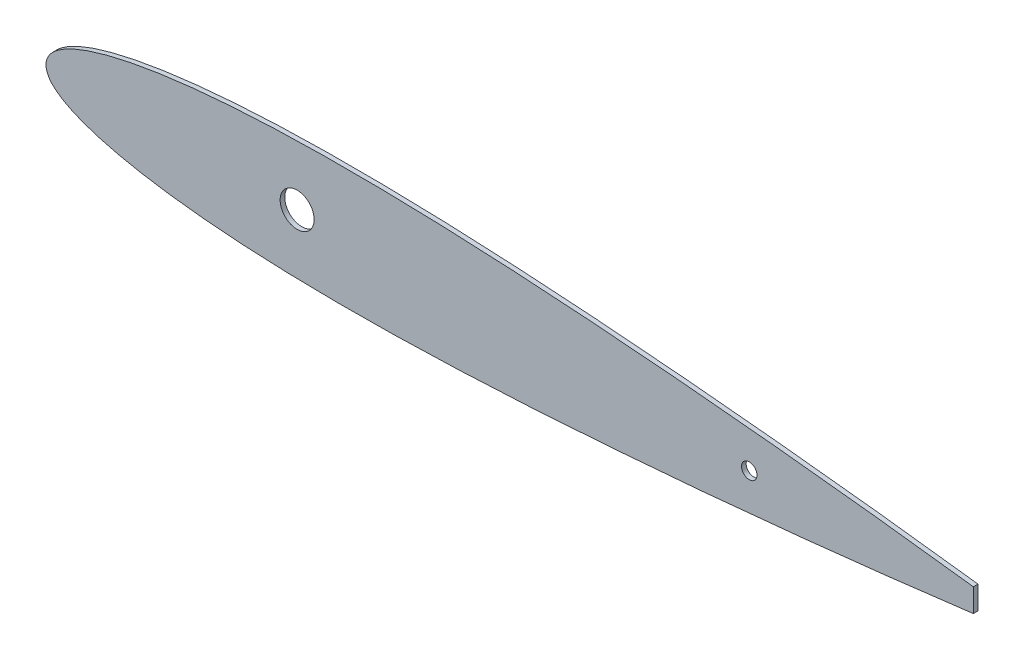
ISO-10303-21;
HEADER;
FILE_DESCRIPTION(('STEP AP214'),'2;1');
FILE_NAME('part.step','',(''),(''),'','','');
FILE_SCHEMA(('AUTOMOTIVE_DESIGN { 1 0 10303 214 1 1 1 1 }'));
ENDSEC;
DATA;
#1=APPLICATION_CONTEXT('core data for automotive mechanical design processes');
#2=APPLICATION_PROTOCOL_DEFINITION('international standard','automotive_design',2000,#1);
#3=PRODUCT_CONTEXT('',#1,'mechanical');
#4=PRODUCT('Part','Part','',(#3));
#5=PRODUCT_RELATED_PRODUCT_CATEGORY('part','',(#4));
#6=PRODUCT_DEFINITION_FORMATION('','',#4);
#7=PRODUCT_DEFINITION_CONTEXT('part definition',#1,'design');
#8=PRODUCT_DEFINITION('design','',#6,#7);
#9=PRODUCT_DEFINITION_SHAPE('','',#8);
#10=(LENGTH_UNIT() NAMED_UNIT(*) SI_UNIT(.MILLI.,.METRE.));
#11=(NAMED_UNIT(*) PLANE_ANGLE_UNIT() SI_UNIT($,.RADIAN.));
#12=(NAMED_UNIT(*) SI_UNIT($,.STERADIAN.) SOLID_ANGLE_UNIT());
#13=UNCERTAINTY_MEASURE_WITH_UNIT(LENGTH_MEASURE(1.E-05),#10,'distance_accuracy_value','');
#14=(GEOMETRIC_REPRESENTATION_CONTEXT(3) GLOBAL_UNCERTAINTY_ASSIGNED_CONTEXT((#13)) GLOBAL_UNIT_ASSIGNED_CONTEXT((#10,
#11,#12)) REPRESENTATION_CONTEXT('',''));
#15=CARTESIAN_POINT('',(0.,0.,0.));
#16=DIRECTION('',(0.,0.,1.));
#17=DIRECTION('',(1.,0.,0.));
#18=AXIS2_PLACEMENT_3D('',#15,#16,#17);
#19=CARTESIAN_POINT('',(325.,0.409500092940086,-1.5));
#20=CARTESIAN_POINT('',(324.209606779707,0.519399758051775,-1.5));
#21=CARTESIAN_POINT('',(322.004222005564,0.826045920870351,-1.5));
#22=CARTESIAN_POINT('',(318.131286115593,1.36247994030202,-1.5));
#23=CARTESIAN_POINT('',(313.205110101778,2.03042977355134,-1.5));
#24=CARTESIAN_POINT('',(307.754214134533,2.75656118582943,-1.5));
#25=CARTESIAN_POINT('',(301.981376014148,3.50796663812488,-1.5));
#26=CARTESIAN_POINT('',(296.03805070342,4.26285960586597,-1.5));
#27=CARTESIAN_POINT('',(290.014777157156,5.01477274252765,-1.5));
#28=CARTESIAN_POINT('',(283.957433959712,5.75582617177158,-1.5));
#29=CARTESIAN_POINT('',(277.884033962146,6.48070926721199,-1.5));
#30=CARTESIAN_POINT('',(271.799371840249,7.19115834138845,-1.5));
#31=CARTESIAN_POINT('',(265.708673260099,7.88859596106562,-1.5));
#32=CARTESIAN_POINT('',(259.617942627013,8.57158743858235,-1.5));
#33=CARTESIAN_POINT('',(253.527208066558,9.23757681253481,-1.5));
#34=CARTESIAN_POINT('',(247.432327629463,9.88675115402497,-1.5));
#35=CARTESIAN_POINT('',(241.332260132785,10.5225031273384,-1.5));
#36=CARTESIAN_POINT('',(235.230560492259,11.1447506557479,-1.5));
#37=CARTESIAN_POINT('',(229.13083924923,11.7508555070343,-1.5));
#38=CARTESIAN_POINT('',(223.034064985933,12.3409491955804,-1.5));
#39=CARTESIAN_POINT('',(216.939113887928,12.9142946059519,-1.5));
#40=CARTESIAN_POINT('',(210.845263014783,13.4708382241848,-1.5));
#41=CARTESIAN_POINT('',(204.753002950035,14.0095743054649,-1.5));
#42=CARTESIAN_POINT('',(198.663296519111,14.5308590099606,-1.5));
#43=CARTESIAN_POINT('',(192.576797706318,15.0327448367373,-1.5));
#44=CARTESIAN_POINT('',(186.493961902939,15.5146771463487,-1.5));
#45=CARTESIAN_POINT('',(180.415624113057,15.9768096198057,-1.5));
#46=CARTESIAN_POINT('',(174.342680028815,16.4170842141137,-1.5));
#47=CARTESIAN_POINT('',(168.275982363255,16.8340297465507,-1.5));
#48=CARTESIAN_POINT('',(162.215629607513,17.2278742693412,-1.5));
#49=CARTESIAN_POINT('',(156.161040662733,17.5953372871964,-1.5));
#50=CARTESIAN_POINT('',(150.112779892537,17.9372096616026,-1.5));
#51=CARTESIAN_POINT('',(144.07339040427,18.2513514924437,-1.5));
#52=CARTESIAN_POINT('',(138.046350310496,18.536066857256,-1.5));
#53=CARTESIAN_POINT('',(132.034044160048,18.7892202902567,-1.5));
#54=CARTESIAN_POINT('',(126.0357766507,19.0073658596617,-1.5));
#55=CARTESIAN_POINT('',(120.050052914781,19.1887400668419,-1.5));
#56=CARTESIAN_POINT('',(114.076331660156,19.3315438188047,-1.5));
#57=CARTESIAN_POINT('',(108.117235085,19.435103873437,-1.5));
#58=CARTESIAN_POINT('',(102.177171609536,19.4963107318144,-1.5));
#59=CARTESIAN_POINT('',(96.2603591758064,19.5109725894807,-1.5));
#60=CARTESIAN_POINT('',(90.3701487394851,19.477507746131,-1.5));
#61=CARTESIAN_POINT('',(84.5091329996222,19.3907618385161,-1.5));
#62=CARTESIAN_POINT('',(78.6807707597626,19.2476243031364,-1.5));
#63=CARTESIAN_POINT('',(72.8895764419092,19.0443694156847,-1.5));
#64=CARTESIAN_POINT('',(67.1420867990853,18.7758127059806,-1.5));
#65=CARTESIAN_POINT('',(61.4473554716223,18.4394562222854,-1.5));
#66=CARTESIAN_POINT('',(55.8188788592684,18.0277086658522,-1.5));
#67=CARTESIAN_POINT('',(50.2754905068751,17.5393749526799,-1.5));
#68=CARTESIAN_POINT('',(44.8436271748396,16.966812040394,-1.5));
#69=CARTESIAN_POINT('',(39.5585789155564,16.3084644660726,-1.5));
#70=CARTESIAN_POINT('',(34.4705276450858,15.5627624363053,-1.5));
#71=CARTESIAN_POINT('',(29.6466115538617,14.7371020011183,-1.5));
#72=CARTESIAN_POINT('',(25.1714180911801,13.847801872696,-1.5));
#73=CARTESIAN_POINT('',(21.1277937118721,12.9136079104224,-1.5));
#74=CARTESIAN_POINT('',(17.5697242584202,11.9649836606135,-1.5));
#75=CARTESIAN_POINT('',(14.5048810711103,11.0230017776017,-1.5));
#76=CARTESIAN_POINT('',(11.9002690745363,10.1112925690979,-1.5));
#77=CARTESIAN_POINT('',(9.70828673327445,9.23223688296207,-1.5));
#78=CARTESIAN_POINT('',(7.87282777342704,8.39255923934502,-1.5));
#79=CARTESIAN_POINT('',(6.33315120465825,7.59484614670781,-1.5));
#80=CARTESIAN_POINT('',(5.03494774774099,6.82568841763681,-1.5));
#81=CARTESIAN_POINT('',(3.930515343935,6.07372451832533,-1.5));
#82=CARTESIAN_POINT('',(2.98116190312321,5.33718940017346,-1.5));
#83=CARTESIAN_POINT('',(2.17337222995275,4.60407807520939,-1.5));
#84=CARTESIAN_POINT('',(1.50639491985592,3.86778199385354,-1.5));
#85=CARTESIAN_POINT('',(0.976010289153697,3.13185481720186,-1.5));
#86=CARTESIAN_POINT('',(0.573308222912518,2.40523809189431,-1.5));
#87=CARTESIAN_POINT('',(0.282112492358061,1.69699756557873,-1.5));
#88=CARTESIAN_POINT('',(0.092781659396528,1.00862248430014,-1.5));
#89=CARTESIAN_POINT('',(-0.0038754219919416,0.334729508331888,-1.5));
#90=CARTESIAN_POINT('',(-0.00387542199174033,-0.334729508332765,-1.5));
#91=CARTESIAN_POINT('',(0.0927816593965284,-1.00862248430096,-1.5));
#92=CARTESIAN_POINT('',(0.282112492358257,-1.69699756557952,-1.5));
#93=CARTESIAN_POINT('',(0.573308222913153,-2.40523809189511,-1.5));
#94=CARTESIAN_POINT('',(0.976010289154229,-3.13185481720259,-1.5));
#95=CARTESIAN_POINT('',(1.50639491985669,-3.86778199385375,-1.5));
#96=CARTESIAN_POINT('',(2.17337222995331,-4.60407807521166,-1.5));
#97=CARTESIAN_POINT('',(2.98116190312569,-5.33718940016601,-1.5));
#98=CARTESIAN_POINT('',(3.93051534393069,-6.07372451835889,-1.5));
#99=CARTESIAN_POINT('',(5.03494774776691,-6.82568841748965,-1.5));
#100=CARTESIAN_POINT('',(6.33315120454887,-7.59484614737161,-1.5));
#101=CARTESIAN_POINT('',(7.87282777394364,-8.39255923625805,-1.5));
#102=CARTESIAN_POINT('',(9.7082867308385,-9.23223689756832,-1.5));
#103=CARTESIAN_POINT('',(11.9002690861303,-10.1112924996381,-1.5));
#104=CARTESIAN_POINT('',(14.5048810162984,-11.023002106052,-1.5));
#105=CARTESIAN_POINT('',(17.5697245150946,-11.964982122603,-1.5));
#106=CARTESIAN_POINT('',(21.1277925315337,-12.9136149831514,-1.5));
#107=CARTESIAN_POINT('',(25.1714233397692,-13.8477704225799,-1.5));
#108=CARTESIAN_POINT('',(29.6465711781048,-14.7372325178627,-1.5));
#109=CARTESIAN_POINT('',(34.4705986764643,-15.5622096745657,-1.5));
#110=CARTESIAN_POINT('',(39.5585394288992,-16.3086186388566,-1.5));
#111=CARTESIAN_POINT('',(44.8436338253308,-16.9667684771388,-1.5));
#112=CARTESIAN_POINT('',(50.2754886705652,-17.5393869812259,-1.5));
#113=CARTESIAN_POINT('',(55.8188793624641,-18.0277053697381,-1.5));
#114=CARTESIAN_POINT('',(61.4473553344781,-18.4394571206421,-1.5));
#115=CARTESIAN_POINT('',(67.142086836335,-18.7758124619893,-1.5));
#116=CARTESIAN_POINT('',(72.8895764318215,-19.044369481772,-1.5));
#117=CARTESIAN_POINT('',(78.6807707624954,-19.2476242852421,-1.5));
#118=CARTESIAN_POINT('',(84.5091329988881,-19.3907618433307,-1.5));
#119=CARTESIAN_POINT('',(90.3701487396878,-19.4775077448097,-1.5));
#120=CARTESIAN_POINT('',(96.2603591757564,-19.5109725898145,-1.5));
#121=CARTESIAN_POINT('',(102.177171609554,-19.4963107317,-1.5));
#122=CARTESIAN_POINT('',(108.117235085,-19.4351038734419,-1.5));
#123=CARTESIAN_POINT('',(114.07633166016,-19.3315438187761,-1.5));
#124=CARTESIAN_POINT('',(120.050052914784,-19.1887400668207,-1.5));
#125=CARTESIAN_POINT('',(126.035776650705,-19.0073658596371,-1.5));
#126=CARTESIAN_POINT('',(132.034044160051,-18.7892202902313,-1.5));
#127=CARTESIAN_POINT('',(138.046350310499,-18.5360668572294,-1.5));
#128=CARTESIAN_POINT('',(144.073390404273,-18.2513514924159,-1.5));
#129=CARTESIAN_POINT('',(150.11277989254,-17.9372096615736,-1.5));
#130=CARTESIAN_POINT('',(156.161040662736,-17.5953372871662,-1.5));
#131=CARTESIAN_POINT('',(162.215629607516,-17.2278742693098,-1.5));
#132=CARTESIAN_POINT('',(168.275982363258,-16.8340297465181,-1.5));
#133=CARTESIAN_POINT('',(174.342680028818,-16.4170842140799,-1.5));
#134=CARTESIAN_POINT('',(180.41562411306,-15.9768096197708,-1.5));
#135=CARTESIAN_POINT('',(186.493961902942,-15.5146771463126,-1.5));
#136=CARTESIAN_POINT('',(192.57679770632,-15.0327448366998,-1.5));
#137=CARTESIAN_POINT('',(198.663296519114,-14.530859009922,-1.5));
#138=CARTESIAN_POINT('',(204.753002950038,-14.0095743054252,-1.5));
#139=CARTESIAN_POINT('',(210.845263014786,-13.4708382241438,-1.5));
#140=CARTESIAN_POINT('',(216.93911388793,-12.9142946059096,-1.5));
#141=CARTESIAN_POINT('',(223.034064985936,-12.3409491955369,-1.5));
#142=CARTESIAN_POINT('',(229.130839249232,-11.7508555069896,-1.5));
#143=CARTESIAN_POINT('',(235.230560492261,-11.144750655702,-1.5));
#144=CARTESIAN_POINT('',(241.332260132787,-10.5225031272913,-1.5));
#145=CARTESIAN_POINT('',(247.432327629465,-9.88675115397669,-1.5));
#146=CARTESIAN_POINT('',(253.527208066559,-9.23757681248529,-1.5));
#147=CARTESIAN_POINT('',(259.617942627016,-8.57158743853166,-1.5));
#148=CARTESIAN_POINT('',(265.7086732601,-7.88859596101362,-1.5));
#149=CARTESIAN_POINT('',(271.79937184025,-7.19115834133532,-1.5));
#150=CARTESIAN_POINT('',(277.884033962148,-6.48070926715762,-1.5));
#151=CARTESIAN_POINT('',(283.957433959714,-5.75582617171604,-1.5));
#152=CARTESIAN_POINT('',(290.014777157157,-5.01477274247086,-1.5));
#153=CARTESIAN_POINT('',(296.038050703421,-4.26285960580798,-1.5));
#154=CARTESIAN_POINT('',(301.98137601415,-3.50796663806573,-1.5));
#155=CARTESIAN_POINT('',(307.754214134534,-2.7565611857691,-1.5));
#156=CARTESIAN_POINT('',(313.205110101779,-2.03042977348995,-1.5));
#157=CARTESIAN_POINT('',(318.131286115593,-1.36247994023965,-1.5));
#158=CARTESIAN_POINT('',(322.004222005565,-0.826045920807204,-1.5));
#159=CARTESIAN_POINT('',(324.209606779707,-0.5193997579882,-1.5));
#160=CARTESIAN_POINT('',(325.,-0.409500092876342,-1.5));
#161=B_SPLINE_CURVE_WITH_KNOTS('',3,(#19,#20,#21,#22,#23,#24,#25,#26,#27,#28,#29,#30,#31,#32,
#33,#34,#35,#36,#37,#38,#39,#40,#41,#42,#43,#44,#45,#46,#47,#48,#49,#50,#51,#52,#53,#54,#55,#56,
#57,#58,#59,#60,#61,#62,#63,#64,#65,#66,#67,#68,#69,#70,#71,#72,#73,#74,#75,#76,#77,#78,#79,#80,
#81,#82,#83,#84,#85,#86,#87,#88,#89,#90,#91,#92,#93,#94,#95,#96,#97,#98,#99,#100,#101,#102,#103,
#104,#105,#106,#107,#108,#109,#110,#111,#112,#113,#114,#115,#116,#117,#118,#119,#120,#121,#122,
#123,#124,#125,#126,#127,#128,#129,#130,#131,#132,#133,#134,#135,#136,#137,#138,#139,#140,#141,
#142,#143,#144,#145,#146,#147,#148,#149,#150,#151,#152,#153,#154,#155,#156,#157,#158,#159,#160),
.UNSPECIFIED.,.F.,.F.,(4,1,1,1,1,1,1,1,1,1,1,1,1,1,1,1,1,1,1,1,1,1,1,1,1,1,1,1,1,1,1,1,1,1,1,1,
1,1,1,1,1,1,1,1,1,1,1,1,1,1,1,1,1,1,1,1,1,1,1,1,1,1,1,1,1,1,1,1,1,1,1,1,1,1,1,1,1,1,1,1,1,1,1,1,
1,1,1,1,1,1,1,1,1,1,1,1,1,1,1,1,1,1,1,1,1,1,1,1,1,1,1,1,1,1,1,1,1,1,1,1,1,1,1,1,1,1,1,1,1,1,1,1,
1,1,1,1,1,1,1,4),(0.,0.00361222059404388,0.0100789532278554,0.0176986181570895,
0.0261151107220122,0.0349709660638799,0.0440503796486832,0.0532343297369713,0.0624475697827881,
0.0716739929600303,0.0809213185094618,0.0901775382979332,0.0994243421366575,0.108664440992277,
0.117912199004999,0.127169502180609,0.136426594565023,0.145675425736823,0.154916495397513,
0.164153236916375,0.173386648526191,0.182615736180586,0.191838089492061,0.201053134496137,
0.210260392550908,0.219458942389608,0.228646746886173,0.237822316287067,0.24698522413025,
0.25613738364592,0.265279415916296,0.274406949966901,0.283512193452554,0.292591781113348,
0.30164628535433,0.310681792653752,0.31969906757785,0.32869451957993,0.337660159695399,
0.346588583205171,0.355477411634764,0.364322937295264,0.373121613643215,0.381867635356829,
0.390553004884712,0.399166025869356,0.407689628257838,0.416098119030288,0.424354887451602,
0.432412428746428,0.440204728485537,0.447630505181733,0.454563637698397,0.460855379429517,
0.466413319364109,0.471228610451128,0.475365774282038,0.478901259753558,0.481915077255184,
0.484498871900912,0.486747127386087,0.488741251833575,0.490543179252672,0.492182103901344,
0.493672830547239,0.495031907807012,0.496279059618418,0.497424736506128,0.498490165528455,
0.499502757789975,0.500497253863142,0.501509846124661,0.502575275146988,0.503720952034698,
0.504968103846104,0.506327181105877,0.507817907751772,0.509456832400444,0.511258759819541,
0.51325288426703,0.515501139752205,0.518084934397933,0.521098751899559,0.524634237371078,
0.528771401201989,0.533586692289008,0.539144632223599,0.545436373954719,0.552369506471383,
0.559795200118754,0.567587571253572,0.575645112548398,0.583901880969712,0.592310371742162,
0.600833974130644,0.609446995115288,0.618132364643171,0.626878386356785,0.635677062704736,
0.644522588365236,0.653411416794829,0.662339840304601,0.67130548042007,0.68030093242215,
0.689318207346248,0.69835371464567,0.707408218886652,0.716487806547446,0.725593050033099,
0.734720584083704,0.74386261635408,0.75301477586975,0.762177683712933,0.771353253113827,
0.780541057610392,0.789739607449093,0.798946865503863,0.808161910507939,0.817384263819414,
0.826613351473809,0.835846763083625,0.845083504602487,0.854324574263177,0.863573405434977,
0.872830497819391,0.882087800995001,0.891335559007723,0.900575657863343,0.909822461702067,
0.919078681490538,0.92832600703997,0.937552430217212,0.946765670263029,0.955949620351317,
0.96502903393612,0.973884889277988,0.982301381842911,0.989921046772145,0.996387779405956,1.),.UNSPECIFIED.);
#162=DIRECTION('',(0.,0.,1.));
#163=VECTOR('',#162,1.);
#164=SURFACE_OF_LINEAR_EXTRUSION('',#161,#163);
#165=CARTESIAN_POINT('',(300.,3.75863619053004,-1.5));
#166=VERTEX_POINT('',#165);
#167=CARTESIAN_POINT('',(300.,-3.75863619047145,-1.5));
#168=VERTEX_POINT('',#167);
#169=EDGE_CURVE('E43',#166,#168,#161,.T.);
#170=ORIENTED_EDGE('',*,*,#169,.T.);
#171=DIRECTION('',(0.,0.,1.));
#172=VECTOR('',#171,1.);
#173=CARTESIAN_POINT('',(300.,-3.75863618856556,-1.5));
#174=LINE('',#173,#172);
#175=CARTESIAN_POINT('',(299.999999985062,-3.75863619047145,0.));
#176=VERTEX_POINT('',#175);
#177=EDGE_CURVE('E63',#176,#168,#174,.F.);
#178=ORIENTED_EDGE('',*,*,#177,.F.);
#179=CARTESIAN_POINT('',(325.,0.409500092940086,0.));
#180=CARTESIAN_POINT('',(324.209606779707,0.519399758051775,0.));
#181=CARTESIAN_POINT('',(322.004222005564,0.826045920870351,0.));
#182=CARTESIAN_POINT('',(318.131286115593,1.36247994030202,0.));
#183=CARTESIAN_POINT('',(313.205110101778,2.03042977355134,0.));
#184=CARTESIAN_POINT('',(307.754214134533,2.75656118582943,0.));
#185=CARTESIAN_POINT('',(301.981376014148,3.50796663812488,0.));
#186=CARTESIAN_POINT('',(296.03805070342,4.26285960586597,0.));
#187=CARTESIAN_POINT('',(290.014777157156,5.01477274252765,0.));
#188=CARTESIAN_POINT('',(283.957433959712,5.75582617177158,0.));
#189=CARTESIAN_POINT('',(277.884033962146,6.48070926721199,0.));
#190=CARTESIAN_POINT('',(271.799371840249,7.19115834138845,0.));
#191=CARTESIAN_POINT('',(265.708673260099,7.88859596106562,0.));
#192=CARTESIAN_POINT('',(259.617942627013,8.57158743858235,0.));
#193=CARTESIAN_POINT('',(253.527208066558,9.23757681253481,0.));
#194=CARTESIAN_POINT('',(247.432327629463,9.88675115402497,0.));
#195=CARTESIAN_POINT('',(241.332260132785,10.5225031273384,0.));
#196=CARTESIAN_POINT('',(235.230560492259,11.1447506557479,0.));
#197=CARTESIAN_POINT('',(229.13083924923,11.7508555070343,0.));
#198=CARTESIAN_POINT('',(223.034064985933,12.3409491955804,0.));
#199=CARTESIAN_POINT('',(216.939113887928,12.9142946059519,0.));
#200=CARTESIAN_POINT('',(210.845263014783,13.4708382241848,0.));
#201=CARTESIAN_POINT('',(204.753002950035,14.0095743054649,0.));
#202=CARTESIAN_POINT('',(198.663296519111,14.5308590099606,0.));
#203=CARTESIAN_POINT('',(192.576797706318,15.0327448367373,0.));
#204=CARTESIAN_POINT('',(186.493961902939,15.5146771463487,0.));
#205=CARTESIAN_POINT('',(180.415624113057,15.9768096198057,0.));
#206=CARTESIAN_POINT('',(174.342680028815,16.4170842141137,0.));
#207=CARTESIAN_POINT('',(168.275982363255,16.8340297465507,0.));
#208=CARTESIAN_POINT('',(162.215629607513,17.2278742693412,0.));
#209=CARTESIAN_POINT('',(156.161040662733,17.5953372871964,0.));
#210=CARTESIAN_POINT('',(150.112779892537,17.9372096616026,0.));
#211=CARTESIAN_POINT('',(144.07339040427,18.2513514924437,0.));
#212=CARTESIAN_POINT('',(138.046350310496,18.536066857256,0.));
#213=CARTESIAN_POINT('',(132.034044160048,18.7892202902567,0.));
#214=CARTESIAN_POINT('',(126.0357766507,19.0073658596617,0.));
#215=CARTESIAN_POINT('',(120.050052914781,19.1887400668419,0.));
#216=CARTESIAN_POINT('',(114.076331660156,19.3315438188047,0.));
#217=CARTESIAN_POINT('',(108.117235085,19.435103873437,0.));
#218=CARTESIAN_POINT('',(102.177171609536,19.4963107318144,0.));
#219=CARTESIAN_POINT('',(96.2603591758064,19.5109725894807,0.));
#220=CARTESIAN_POINT('',(90.3701487394851,19.477507746131,0.));
#221=CARTESIAN_POINT('',(84.5091329996222,19.3907618385161,0.));
#222=CARTESIAN_POINT('',(78.6807707597626,19.2476243031364,0.));
#223=CARTESIAN_POINT('',(72.8895764419092,19.0443694156847,0.));
#224=CARTESIAN_POINT('',(67.1420867990853,18.7758127059806,0.));
#225=CARTESIAN_POINT('',(61.4473554716223,18.4394562222854,0.));
#226=CARTESIAN_POINT('',(55.8188788592684,18.0277086658522,0.));
#227=CARTESIAN_POINT('',(50.2754905068751,17.5393749526799,0.));
#228=CARTESIAN_POINT('',(44.8436271748396,16.966812040394,0.));
#229=CARTESIAN_POINT('',(39.5585789155564,16.3084644660726,0.));
#230=CARTESIAN_POINT('',(34.4705276450858,15.5627624363053,0.));
#231=CARTESIAN_POINT('',(29.6466115538617,14.7371020011183,0.));
#232=CARTESIAN_POINT('',(25.1714180911801,13.847801872696,0.));
#233=CARTESIAN_POINT('',(21.1277937118721,12.9136079104224,0.));
#234=CARTESIAN_POINT('',(17.5697242584202,11.9649836606135,0.));
#235=CARTESIAN_POINT('',(14.5048810711103,11.0230017776017,0.));
#236=CARTESIAN_POINT('',(11.9002690745363,10.1112925690979,0.));
#237=CARTESIAN_POINT('',(9.70828673327445,9.23223688296207,0.));
#238=CARTESIAN_POINT('',(7.87282777342704,8.39255923934502,0.));
#239=CARTESIAN_POINT('',(6.33315120465825,7.59484614670781,0.));
#240=CARTESIAN_POINT('',(5.03494774774099,6.82568841763681,0.));
#241=CARTESIAN_POINT('',(3.930515343935,6.07372451832533,0.));
#242=CARTESIAN_POINT('',(2.98116190312321,5.33718940017346,0.));
#243=CARTESIAN_POINT('',(2.17337222995275,4.60407807520939,0.));
#244=CARTESIAN_POINT('',(1.50639491985592,3.86778199385354,0.));
#245=CARTESIAN_POINT('',(0.976010289153697,3.13185481720186,0.));
#246=CARTESIAN_POINT('',(0.573308222912518,2.40523809189431,0.));
#247=CARTESIAN_POINT('',(0.282112492358061,1.69699756557873,0.));
#248=CARTESIAN_POINT('',(0.092781659396528,1.00862248430014,0.));
#249=CARTESIAN_POINT('',(-0.0038754219919416,0.334729508331888,0.));
#250=CARTESIAN_POINT('',(-0.00387542199174033,-0.334729508332765,0.));
#251=CARTESIAN_POINT('',(0.0927816593965284,-1.00862248430096,0.));
#252=CARTESIAN_POINT('',(0.282112492358257,-1.69699756557952,0.));
#253=CARTESIAN_POINT('',(0.573308222913153,-2.40523809189511,0.));
#254=CARTESIAN_POINT('',(0.976010289154229,-3.13185481720259,0.));
#255=CARTESIAN_POINT('',(1.50639491985669,-3.86778199385375,0.));
#256=CARTESIAN_POINT('',(2.17337222995331,-4.60407807521166,0.));
#257=CARTESIAN_POINT('',(2.98116190312569,-5.33718940016601,0.));
#258=CARTESIAN_POINT('',(3.93051534393069,-6.07372451835889,0.));
#259=CARTESIAN_POINT('',(5.03494774776691,-6.82568841748965,0.));
#260=CARTESIAN_POINT('',(6.33315120454887,-7.59484614737161,0.));
#261=CARTESIAN_POINT('',(7.87282777394364,-8.39255923625805,0.));
#262=CARTESIAN_POINT('',(9.7082867308385,-9.23223689756832,0.));
#263=CARTESIAN_POINT('',(11.9002690861303,-10.1112924996381,0.));
#264=CARTESIAN_POINT('',(14.5048810162984,-11.023002106052,0.));
#265=CARTESIAN_POINT('',(17.5697245150946,-11.964982122603,0.));
#266=CARTESIAN_POINT('',(21.1277925315337,-12.9136149831514,0.));
#267=CARTESIAN_POINT('',(25.1714233397692,-13.8477704225799,0.));
#268=CARTESIAN_POINT('',(29.6465711781048,-14.7372325178627,0.));
#269=CARTESIAN_POINT('',(34.4705986764643,-15.5622096745657,0.));
#270=CARTESIAN_POINT('',(39.5585394288992,-16.3086186388566,0.));
#271=CARTESIAN_POINT('',(44.8436338253308,-16.9667684771388,0.));
#272=CARTESIAN_POINT('',(50.2754886705652,-17.5393869812259,0.));
#273=CARTESIAN_POINT('',(55.8188793624641,-18.0277053697381,0.));
#274=CARTESIAN_POINT('',(61.4473553344781,-18.4394571206421,0.));
#275=CARTESIAN_POINT('',(67.142086836335,-18.7758124619893,0.));
#276=CARTESIAN_POINT('',(72.8895764318215,-19.044369481772,0.));
#277=CARTESIAN_POINT('',(78.6807707624954,-19.2476242852421,0.));
#278=CARTESIAN_POINT('',(84.5091329988881,-19.3907618433307,0.));
#279=CARTESIAN_POINT('',(90.3701487396878,-19.4775077448097,0.));
#280=CARTESIAN_POINT('',(96.2603591757564,-19.5109725898145,0.));
#281=CARTESIAN_POINT('',(102.177171609554,-19.4963107317,0.));
#282=CARTESIAN_POINT('',(108.117235085,-19.4351038734419,0.));
#283=CARTESIAN_POINT('',(114.07633166016,-19.3315438187761,0.));
#284=CARTESIAN_POINT('',(120.050052914784,-19.1887400668207,0.));
#285=CARTESIAN_POINT('',(126.035776650705,-19.0073658596371,0.));
#286=CARTESIAN_POINT('',(132.034044160051,-18.7892202902313,0.));
#287=CARTESIAN_POINT('',(138.046350310499,-18.5360668572294,0.));
#288=CARTESIAN_POINT('',(144.073390404273,-18.2513514924159,0.));
#289=CARTESIAN_POINT('',(150.11277989254,-17.9372096615736,0.));
#290=CARTESIAN_POINT('',(156.161040662736,-17.5953372871662,0.));
#291=CARTESIAN_POINT('',(162.215629607516,-17.2278742693098,0.));
#292=CARTESIAN_POINT('',(168.275982363258,-16.8340297465181,0.));
#293=CARTESIAN_POINT('',(174.342680028818,-16.4170842140799,0.));
#294=CARTESIAN_POINT('',(180.41562411306,-15.9768096197708,0.));
#295=CARTESIAN_POINT('',(186.493961902942,-15.5146771463126,0.));
#296=CARTESIAN_POINT('',(192.57679770632,-15.0327448366998,0.));
#297=CARTESIAN_POINT('',(198.663296519114,-14.530859009922,0.));
#298=CARTESIAN_POINT('',(204.753002950038,-14.0095743054252,0.));
#299=CARTESIAN_POINT('',(210.845263014786,-13.4708382241438,0.));
#300=CARTESIAN_POINT('',(216.93911388793,-12.9142946059096,0.));
#301=CARTESIAN_POINT('',(223.034064985936,-12.3409491955369,0.));
#302=CARTESIAN_POINT('',(229.130839249232,-11.7508555069896,0.));
#303=CARTESIAN_POINT('',(235.230560492261,-11.144750655702,0.));
#304=CARTESIAN_POINT('',(241.332260132787,-10.5225031272913,0.));
#305=CARTESIAN_POINT('',(247.432327629465,-9.88675115397669,0.));
#306=CARTESIAN_POINT('',(253.527208066559,-9.23757681248529,0.));
#307=CARTESIAN_POINT('',(259.617942627016,-8.57158743853166,0.));
#308=CARTESIAN_POINT('',(265.7086732601,-7.88859596101362,0.));
#309=CARTESIAN_POINT('',(271.79937184025,-7.19115834133532,0.));
#310=CARTESIAN_POINT('',(277.884033962148,-6.48070926715762,0.));
#311=CARTESIAN_POINT('',(283.957433959714,-5.75582617171604,0.));
#312=CARTESIAN_POINT('',(290.014777157157,-5.01477274247086,0.));
#313=CARTESIAN_POINT('',(296.038050703421,-4.26285960580798,0.));
#314=CARTESIAN_POINT('',(301.98137601415,-3.50796663806573,0.));
#315=CARTESIAN_POINT('',(307.754214134534,-2.7565611857691,0.));
#316=CARTESIAN_POINT('',(313.205110101779,-2.03042977348995,0.));
#317=CARTESIAN_POINT('',(318.131286115593,-1.36247994023965,0.));
#318=CARTESIAN_POINT('',(322.004222005565,-0.826045920807204,0.));
#319=CARTESIAN_POINT('',(324.209606779707,-0.5193997579882,0.));
#320=CARTESIAN_POINT('',(325.,-0.409500092876342,0.));
#321=B_SPLINE_CURVE_WITH_KNOTS('',3,(#179,#180,#181,#182,#183,#184,#185,#186,#187,#188,#189,
#190,#191,#192,#193,#194,#195,#196,#197,#198,#199,#200,#201,#202,#203,#204,#205,#206,#207,#208,
#209,#210,#211,#212,#213,#214,#215,#216,#217,#218,#219,#220,#221,#222,#223,#224,#225,#226,#227,
#228,#229,#230,#231,#232,#233,#234,#235,#236,#237,#238,#239,#240,#241,#242,#243,#244,#245,#246,
#247,#248,#249,#250,#251,#252,#253,#254,#255,#256,#257,#258,#259,#260,#261,#262,#263,#264,#265,
#266,#267,#268,#269,#270,#271,#272,#273,#274,#275,#276,#277,#278,#279,#280,#281,#282,#283,#284,
#285,#286,#287,#288,#289,#290,#291,#292,#293,#294,#295,#296,#297,#298,#299,#300,#301,#302,#303,
#304,#305,#306,#307,#308,#309,#310,#311,#312,#313,#314,#315,#316,#317,#318,#319,#320),
.UNSPECIFIED.,.F.,.F.,(4,1,1,1,1,1,1,1,1,1,1,1,1,1,1,1,1,1,1,1,1,1,1,1,1,1,1,1,1,1,1,1,1,1,1,1,
1,1,1,1,1,1,1,1,1,1,1,1,1,1,1,1,1,1,1,1,1,1,1,1,1,1,1,1,1,1,1,1,1,1,1,1,1,1,1,1,1,1,1,1,1,1,1,1,
1,1,1,1,1,1,1,1,1,1,1,1,1,1,1,1,1,1,1,1,1,1,1,1,1,1,1,1,1,1,1,1,1,1,1,1,1,1,1,1,1,1,1,1,1,1,1,1,
1,1,1,1,1,1,1,4),(0.,0.00361222059404388,0.0100789532278554,0.0176986181570895,
0.0261151107220122,0.0349709660638799,0.0440503796486832,0.0532343297369713,0.0624475697827881,
0.0716739929600303,0.0809213185094618,0.0901775382979332,0.0994243421366575,0.108664440992277,
0.117912199004999,0.127169502180609,0.136426594565023,0.145675425736823,0.154916495397513,
0.164153236916375,0.173386648526191,0.182615736180586,0.191838089492061,0.201053134496137,
0.210260392550908,0.219458942389608,0.228646746886173,0.237822316287067,0.24698522413025,
0.25613738364592,0.265279415916296,0.274406949966901,0.283512193452554,0.292591781113348,
0.30164628535433,0.310681792653752,0.31969906757785,0.32869451957993,0.337660159695399,
0.346588583205171,0.355477411634764,0.364322937295264,0.373121613643215,0.381867635356829,
0.390553004884712,0.399166025869356,0.407689628257838,0.416098119030288,0.424354887451602,
0.432412428746428,0.440204728485537,0.447630505181733,0.454563637698397,0.460855379429517,
0.466413319364109,0.471228610451128,0.475365774282038,0.478901259753558,0.481915077255184,
0.484498871900912,0.486747127386087,0.488741251833575,0.490543179252672,0.492182103901344,
0.493672830547239,0.495031907807012,0.496279059618418,0.497424736506128,0.498490165528455,
0.499502757789975,0.500497253863142,0.501509846124661,0.502575275146988,0.503720952034698,
0.504968103846104,0.506327181105877,0.507817907751772,0.509456832400444,0.511258759819541,
0.51325288426703,0.515501139752205,0.518084934397933,0.521098751899559,0.524634237371078,
0.528771401201989,0.533586692289008,0.539144632223599,0.545436373954719,0.552369506471383,
0.559795200118754,0.567587571253572,0.575645112548398,0.583901880969712,0.592310371742162,
0.600833974130644,0.609446995115288,0.618132364643171,0.626878386356785,0.635677062704736,
0.644522588365236,0.653411416794829,0.662339840304601,0.67130548042007,0.68030093242215,
0.689318207346248,0.69835371464567,0.707408218886652,0.716487806547446,0.725593050033099,
0.734720584083704,0.74386261635408,0.75301477586975,0.762177683712933,0.771353253113827,
0.780541057610392,0.789739607449093,0.798946865503863,0.808161910507939,0.817384263819414,
0.826613351473809,0.835846763083625,0.845083504602487,0.854324574263177,0.863573405434977,
0.872830497819391,0.882087800995001,0.891335559007723,0.900575657863343,0.909822461702067,
0.919078681490538,0.92832600703997,0.937552430217212,0.946765670263029,0.955949620351317,
0.96502903393612,0.973884889277988,0.982301381842911,0.989921046772145,0.996387779405956,1.),.UNSPECIFIED.);
#322=CARTESIAN_POINT('',(300.,3.75863619053004,0.));
#323=VERTEX_POINT('',#322);
#324=EDGE_CURVE('E71',#323,#176,#321,.T.);
#325=ORIENTED_EDGE('',*,*,#324,.F.);
#326=DIRECTION('',(0.,0.,1.));
#327=VECTOR('',#326,1.);
#328=CARTESIAN_POINT('',(300.,3.75863618862417,-1.5));
#329=LINE('',#328,#327);
#330=EDGE_CURVE('E69',#166,#323,#329,.T.);
#331=ORIENTED_EDGE('',*,*,#330,.F.);
#332=EDGE_LOOP('',(#170,#178,#325,#331));
#333=FACE_BOUND('',#332,.T.);
#334=ADVANCED_FACE('F35',(#333),#164,.T.);
#335=CARTESIAN_POINT('',(1.60526481052116E-12,3.86495872226777E-06,-1.5));
#336=DIRECTION('',(0.,0.,1.));
#337=DIRECTION('',(-1.,0.,0.));
#338=AXIS2_PLACEMENT_3D('',#335,#336,#337);
#339=PLANE('',#338);
#340=CARTESIAN_POINT('',(81.25,0.,-1.5));
#341=DIRECTION('',(0.,0.,1.));
#342=DIRECTION('',(1.,0.,0.));
#343=AXIS2_PLACEMENT_3D('',#340,#341,#342);
#344=CIRCLE('',#343,5.5);
#345=CARTESIAN_POINT('',(86.75,0.,-1.5));
#346=VERTEX_POINT('',#345);
#347=EDGE_CURVE('E91',#346,#346,#344,.T.);
#348=ORIENTED_EDGE('',*,*,#347,.T.);
#349=EDGE_LOOP('',(#348));
#350=FACE_BOUND('',#349,.T.);
#351=CARTESIAN_POINT('',(227.5,0.,-1.5));
#352=DIRECTION('',(0.,0.,1.));
#353=DIRECTION('',(1.,0.,0.));
#354=AXIS2_PLACEMENT_3D('',#351,#352,#353);
#355=CIRCLE('',#354,2.50000000000002);
#356=CARTESIAN_POINT('',(230.,0.,-1.5));
#357=VERTEX_POINT('',#356);
#358=EDGE_CURVE('E77',#357,#357,#355,.T.);
#359=ORIENTED_EDGE('',*,*,#358,.T.);
#360=EDGE_LOOP('',(#359));
#361=FACE_BOUND('',#360,.T.);
#362=ORIENTED_EDGE('',*,*,#169,.F.);
#363=DIRECTION('',(0.,1.,0.));
#364=VECTOR('',#363,1.);
#365=CARTESIAN_POINT('',(300.,-19.5109725898145,-1.5));
#366=LINE('',#365,#364);
#367=EDGE_CURVE('E59',#168,#166,#366,.T.);
#368=ORIENTED_EDGE('',*,*,#367,.F.);
#369=EDGE_LOOP('',(#362,#368));
#370=FACE_BOUND('',#369,.T.);
#371=ADVANCED_FACE('F60',(#350,#361,#370),#339,.F.);
#372=CARTESIAN_POINT('',(1.60526481052116E-12,3.86495872226777E-06,0.));
#373=DIRECTION('',(0.,0.,1.));
#374=DIRECTION('',(-1.,0.,0.));
#375=AXIS2_PLACEMENT_3D('',#372,#373,#374);
#376=PLANE('',#375);
#377=DIRECTION('',(0.,1.,0.));
#378=VECTOR('',#377,1.);
#379=CARTESIAN_POINT('',(300.,3.86495872226777E-06,0.));
#380=LINE('',#379,#378);
#381=EDGE_CURVE('E11',#176,#323,#380,.T.);
#382=ORIENTED_EDGE('',*,*,#381,.T.);
#383=ORIENTED_EDGE('',*,*,#324,.T.);
#384=EDGE_LOOP('',(#382,#383));
#385=FACE_BOUND('',#384,.T.);
#386=CARTESIAN_POINT('',(81.25,0.,0.));
#387=DIRECTION('',(0.,0.,1.));
#388=DIRECTION('',(1.,0.,0.));
#389=AXIS2_PLACEMENT_3D('',#386,#387,#388);
#390=CIRCLE('',#389,5.5);
#391=CARTESIAN_POINT('',(86.75,0.,0.));
#392=VERTEX_POINT('',#391);
#393=EDGE_CURVE('E72',#392,#392,#390,.T.);
#394=ORIENTED_EDGE('',*,*,#393,.F.);
#395=EDGE_LOOP('',(#394));
#396=FACE_BOUND('',#395,.T.);
#397=CARTESIAN_POINT('',(227.5,0.,0.));
#398=DIRECTION('',(0.,0.,1.));
#399=DIRECTION('',(1.,0.,0.));
#400=AXIS2_PLACEMENT_3D('',#397,#398,#399);
#401=CIRCLE('',#400,2.50000000000002);
#402=CARTESIAN_POINT('',(230.,0.,0.));
#403=VERTEX_POINT('',#402);
#404=EDGE_CURVE('E88',#403,#403,#401,.T.);
#405=ORIENTED_EDGE('',*,*,#404,.F.);
#406=EDGE_LOOP('',(#405));
#407=FACE_BOUND('',#406,.T.);
#408=ADVANCED_FACE('F96',(#385,#396,#407),#376,.T.);
#409=CARTESIAN_POINT('',(227.5,0.,0.));
#410=DIRECTION('',(0.,0.,-1.));
#411=DIRECTION('',(1.,0.,0.));
#412=AXIS2_PLACEMENT_3D('',#409,#410,#411);
#413=CYLINDRICAL_SURFACE('',#412,2.50000000000002);
#414=ORIENTED_EDGE('',*,*,#404,.T.);
#415=EDGE_LOOP('',(#414));
#416=FACE_BOUND('',#415,.T.);
#417=ORIENTED_EDGE('',*,*,#358,.F.);
#418=EDGE_LOOP('',(#417));
#419=FACE_BOUND('',#418,.T.);
#420=ADVANCED_FACE('F99',(#416,#419),#413,.F.);
#421=CARTESIAN_POINT('',(81.25,0.,0.));
#422=DIRECTION('',(0.,0.,-1.));
#423=DIRECTION('',(1.,0.,0.));
#424=AXIS2_PLACEMENT_3D('',#421,#422,#423);
#425=CYLINDRICAL_SURFACE('',#424,5.5);
#426=ORIENTED_EDGE('',*,*,#393,.T.);
#427=EDGE_LOOP('',(#426));
#428=FACE_BOUND('',#427,.T.);
#429=ORIENTED_EDGE('',*,*,#347,.F.);
#430=EDGE_LOOP('',(#429));
#431=FACE_BOUND('',#430,.T.);
#432=ADVANCED_FACE('F106',(#428,#431),#425,.F.);
#433=CARTESIAN_POINT('',(300.,-19.5109725898145,0.));
#434=DIRECTION('',(-1.,0.,0.));
#435=DIRECTION('',(0.,0.,-1.));
#436=AXIS2_PLACEMENT_3D('',#433,#434,#435);
#437=PLANE('',#436);
#438=ORIENTED_EDGE('',*,*,#367,.T.);
#439=ORIENTED_EDGE('',*,*,#330,.T.);
#440=ORIENTED_EDGE('',*,*,#381,.F.);
#441=ORIENTED_EDGE('',*,*,#177,.T.);
#442=EDGE_LOOP('',(#438,#439,#440,#441));
#443=FACE_BOUND('',#442,.T.);
#444=ADVANCED_FACE('F66',(#443),#437,.F.);
#445=CLOSED_SHELL('',(#334,#371,#408,#420,#432,#444));
#446=MANIFOLD_SOLID_BREP('B2',#445);
#447=ADVANCED_BREP_SHAPE_REPRESENTATION('',(#18,#446),#14);
#448=SHAPE_DEFINITION_REPRESENTATION(#9,#447);
ENDSEC;
END-ISO-10303-21;
